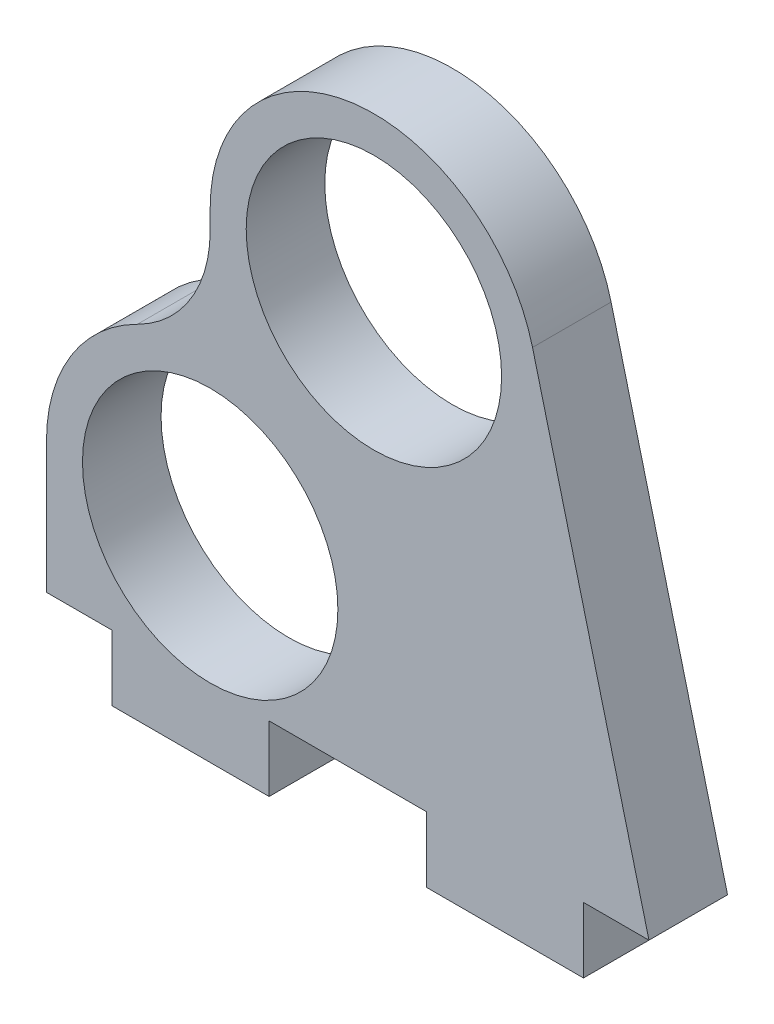
ISO-10303-21;
HEADER;
FILE_DESCRIPTION(('STEP AP214'),'2;1');
FILE_NAME('part.step','',(''),(''),'','','');
FILE_SCHEMA(('AUTOMOTIVE_DESIGN { 1 0 10303 214 1 1 1 1 }'));
ENDSEC;
DATA;
#1=APPLICATION_CONTEXT('core data for automotive mechanical design processes');
#2=APPLICATION_PROTOCOL_DEFINITION('international standard','automotive_design',2000,#1);
#3=PRODUCT_CONTEXT('',#1,'mechanical');
#4=PRODUCT('Part','Part','',(#3));
#5=PRODUCT_RELATED_PRODUCT_CATEGORY('part','',(#4));
#6=PRODUCT_DEFINITION_FORMATION('','',#4);
#7=PRODUCT_DEFINITION_CONTEXT('part definition',#1,'design');
#8=PRODUCT_DEFINITION('design','',#6,#7);
#9=PRODUCT_DEFINITION_SHAPE('','',#8);
#10=(LENGTH_UNIT() NAMED_UNIT(*) SI_UNIT(.MILLI.,.METRE.));
#11=(NAMED_UNIT(*) PLANE_ANGLE_UNIT() SI_UNIT($,.RADIAN.));
#12=(NAMED_UNIT(*) SI_UNIT($,.STERADIAN.) SOLID_ANGLE_UNIT());
#13=UNCERTAINTY_MEASURE_WITH_UNIT(LENGTH_MEASURE(1.E-05),#10,'distance_accuracy_value','');
#14=(GEOMETRIC_REPRESENTATION_CONTEXT(3) GLOBAL_UNCERTAINTY_ASSIGNED_CONTEXT((#13)) GLOBAL_UNIT_ASSIGNED_CONTEXT((#10,
#11,#12)) REPRESENTATION_CONTEXT('',''));
#15=CARTESIAN_POINT('',(0.,0.,0.));
#16=DIRECTION('',(0.,0.,1.));
#17=DIRECTION('',(1.,0.,0.));
#18=AXIS2_PLACEMENT_3D('',#15,#16,#17);
#19=CARTESIAN_POINT('',(12.5000000000001,21.6506350946109,6.));
#20=DIRECTION('',(0.,0.,1.));
#21=DIRECTION('',(1.,0.,0.));
#22=AXIS2_PLACEMENT_3D('',#19,#20,#21);
#23=PLANE('',#22);
#24=CARTESIAN_POINT('',(0.,0.,6.));
#25=DIRECTION('',(0.,0.,1.));
#26=DIRECTION('',(1.,0.,0.));
#27=AXIS2_PLACEMENT_3D('',#24,#25,#26);
#28=CIRCLE('',#27,9.75);
#29=CARTESIAN_POINT('',(9.75,0.,6.));
#30=VERTEX_POINT('',#29);
#31=EDGE_CURVE('E176',#30,#30,#28,.T.);
#32=ORIENTED_EDGE('',*,*,#31,.F.);
#33=EDGE_LOOP('',(#32));
#34=FACE_BOUND('',#33,.T.);
#35=DIRECTION('',(1.,0.,0.));
#36=VECTOR('',#35,1.);
#37=CARTESIAN_POINT('',(-12.5,-10.,6.));
#38=LINE('',#37,#36);
#39=CARTESIAN_POINT('',(-12.5,-10.,6.));
#40=VERTEX_POINT('',#39);
#41=CARTESIAN_POINT('',(-7.5,-10.,6.));
#42=VERTEX_POINT('',#41);
#43=EDGE_CURVE('E201',#40,#42,#38,.T.);
#44=ORIENTED_EDGE('',*,*,#43,.T.);
#45=DIRECTION('',(0.,-1.,0.));
#46=VECTOR('',#45,1.);
#47=CARTESIAN_POINT('',(-7.5,-15.,6.));
#48=LINE('',#47,#46);
#49=CARTESIAN_POINT('',(-7.5,-15.,6.));
#50=VERTEX_POINT('',#49);
#51=EDGE_CURVE('E114',#42,#50,#48,.T.);
#52=ORIENTED_EDGE('',*,*,#51,.T.);
#53=DIRECTION('',(1.,0.,0.));
#54=VECTOR('',#53,1.);
#55=CARTESIAN_POINT('',(4.5,-15.,6.));
#56=LINE('',#55,#54);
#57=CARTESIAN_POINT('',(4.5,-15.,6.));
#58=VERTEX_POINT('',#57);
#59=EDGE_CURVE('E237',#50,#58,#56,.T.);
#60=ORIENTED_EDGE('',*,*,#59,.T.);
#61=DIRECTION('',(0.,1.,0.));
#62=VECTOR('',#61,1.);
#63=CARTESIAN_POINT('',(4.5,-15.,6.));
#64=LINE('',#63,#62);
#65=CARTESIAN_POINT('',(4.5,-10.,6.));
#66=VERTEX_POINT('',#65);
#67=EDGE_CURVE('E256',#58,#66,#64,.T.);
#68=ORIENTED_EDGE('',*,*,#67,.T.);
#69=DIRECTION('',(1.,0.,0.));
#70=VECTOR('',#69,1.);
#71=CARTESIAN_POINT('',(16.5,-10.,6.));
#72=LINE('',#71,#70);
#73=CARTESIAN_POINT('',(16.5,-10.,6.));
#74=VERTEX_POINT('',#73);
#75=EDGE_CURVE('E253',#66,#74,#72,.T.);
#76=ORIENTED_EDGE('',*,*,#75,.T.);
#77=DIRECTION('',(0.,-1.,0.));
#78=VECTOR('',#77,1.);
#79=CARTESIAN_POINT('',(16.5,-15.,6.));
#80=LINE('',#79,#78);
#81=CARTESIAN_POINT('',(16.5,-15.,6.));
#82=VERTEX_POINT('',#81);
#83=EDGE_CURVE('E255',#74,#82,#80,.T.);
#84=ORIENTED_EDGE('',*,*,#83,.T.);
#85=DIRECTION('',(1.,0.,0.));
#86=VECTOR('',#85,1.);
#87=CARTESIAN_POINT('',(28.5,-15.,6.));
#88=LINE('',#87,#86);
#89=CARTESIAN_POINT('',(28.5,-15.,6.));
#90=VERTEX_POINT('',#89);
#91=EDGE_CURVE('E258',#82,#90,#88,.T.);
#92=ORIENTED_EDGE('',*,*,#91,.T.);
#93=DIRECTION('',(0.,1.,0.));
#94=VECTOR('',#93,1.);
#95=CARTESIAN_POINT('',(28.5,-15.,6.));
#96=LINE('',#95,#94);
#97=CARTESIAN_POINT('',(28.5,-10.,6.));
#98=VERTEX_POINT('',#97);
#99=EDGE_CURVE('E264',#90,#98,#96,.T.);
#100=ORIENTED_EDGE('',*,*,#99,.T.);
#101=DIRECTION('',(1.,0.,0.));
#102=VECTOR('',#101,1.);
#103=CARTESIAN_POINT('',(28.5,-10.,6.));
#104=LINE('',#103,#102);
#105=CARTESIAN_POINT('',(33.5,-10.,6.));
#106=VERTEX_POINT('',#105);
#107=EDGE_CURVE('E266',#98,#106,#104,.T.);
#108=ORIENTED_EDGE('',*,*,#107,.T.);
#109=DIRECTION('',(-0.247854237885738,0.96879733523688,0.));
#110=VECTOR('',#109,1.);
#111=CARTESIAN_POINT('',(33.5,-10.,6.));
#112=LINE('',#111,#110);
#113=CARTESIAN_POINT('',(24.6099666904611,24.7488130681826,6.));
#114=VERTEX_POINT('',#113);
#115=EDGE_CURVE('E268',#106,#114,#112,.T.);
#116=ORIENTED_EDGE('',*,*,#115,.T.);
#117=CARTESIAN_POINT('',(12.5000000000001,21.6506350946109,6.));
#118=DIRECTION('',(0.,0.,1.));
#119=DIRECTION('',(1.,0.,0.));
#120=AXIS2_PLACEMENT_3D('',#117,#118,#119);
#121=CIRCLE('',#120,12.5);
#122=CARTESIAN_POINT('',(0.,21.6506350946108,6.));
#123=VERTEX_POINT('',#122);
#124=EDGE_CURVE('E270',#114,#123,#121,.T.);
#125=ORIENTED_EDGE('',*,*,#124,.T.);
#126=DIRECTION('',(0.,-1.,0.));
#127=VECTOR('',#126,1.);
#128=CARTESIAN_POINT('',(0.,21.6506350946108,6.));
#129=LINE('',#128,#127);
#130=CARTESIAN_POINT('',(0.,20.1556443707463,6.));
#131=VERTEX_POINT('',#130);
#132=EDGE_CURVE('E154',#123,#131,#129,.T.);
#133=ORIENTED_EDGE('',*,*,#132,.T.);
#134=CARTESIAN_POINT('',(-9.99999999999992,20.1556443707464,6.));
#135=DIRECTION('',(0.,0.,-1.));
#136=DIRECTION('',(-1.,0.,0.));
#137=AXIS2_PLACEMENT_3D('',#134,#135,#136);
#138=CIRCLE('',#137,10.);
#139=CARTESIAN_POINT('',(-5.55555555555551,11.1975802059702,6.));
#140=VERTEX_POINT('',#139);
#141=EDGE_CURVE('E148',#131,#140,#138,.T.);
#142=ORIENTED_EDGE('',*,*,#141,.T.);
#143=CARTESIAN_POINT('',(0.,0.,6.));
#144=DIRECTION('',(0.,0.,1.));
#145=DIRECTION('',(1.,0.,0.));
#146=AXIS2_PLACEMENT_3D('',#143,#144,#145);
#147=CIRCLE('',#146,12.5);
#148=CARTESIAN_POINT('',(-12.5,0.,6.));
#149=VERTEX_POINT('',#148);
#150=EDGE_CURVE('E152',#140,#149,#147,.T.);
#151=ORIENTED_EDGE('',*,*,#150,.T.);
#152=DIRECTION('',(0.,-1.,0.));
#153=VECTOR('',#152,1.);
#154=CARTESIAN_POINT('',(-12.5,0.,6.));
#155=LINE('',#154,#153);
#156=EDGE_CURVE('E50',#149,#40,#155,.T.);
#157=ORIENTED_EDGE('',*,*,#156,.T.);
#158=EDGE_LOOP('',(#44,#52,#60,#68,#76,#84,#92,#100,#108,#116,#125,#133,#142,#151,#157));
#159=FACE_BOUND('',#158,.T.);
#160=CARTESIAN_POINT('',(12.5000000000001,21.6506350946109,6.));
#161=DIRECTION('',(0.,0.,1.));
#162=DIRECTION('',(1.,0.,0.));
#163=AXIS2_PLACEMENT_3D('',#160,#161,#162);
#164=CIRCLE('',#163,9.75);
#165=CARTESIAN_POINT('',(22.2500000000001,21.6506350946109,6.));
#166=VERTEX_POINT('',#165);
#167=EDGE_CURVE('E312',#166,#166,#164,.T.);
#168=ORIENTED_EDGE('',*,*,#167,.F.);
#169=EDGE_LOOP('',(#168));
#170=FACE_BOUND('',#169,.T.);
#171=ADVANCED_FACE('F33',(#34,#159,#170),#23,.T.);
#172=CARTESIAN_POINT('',(12.5000000000001,21.6506350946109,0.));
#173=DIRECTION('',(0.,0.,1.));
#174=DIRECTION('',(1.,0.,0.));
#175=AXIS2_PLACEMENT_3D('',#172,#173,#174);
#176=PLANE('',#175);
#177=DIRECTION('',(1.,0.,0.));
#178=VECTOR('',#177,1.);
#179=CARTESIAN_POINT('',(-12.5,-10.,0.));
#180=LINE('',#179,#178);
#181=CARTESIAN_POINT('',(-12.5,-10.,0.));
#182=VERTEX_POINT('',#181);
#183=CARTESIAN_POINT('',(-7.5,-10.,0.));
#184=VERTEX_POINT('',#183);
#185=EDGE_CURVE('E172',#182,#184,#180,.T.);
#186=ORIENTED_EDGE('',*,*,#185,.F.);
#187=DIRECTION('',(0.,-1.,0.));
#188=VECTOR('',#187,1.);
#189=CARTESIAN_POINT('',(-12.5,0.,0.));
#190=LINE('',#189,#188);
#191=CARTESIAN_POINT('',(-12.5,0.,0.));
#192=VERTEX_POINT('',#191);
#193=EDGE_CURVE('E106',#192,#182,#190,.T.);
#194=ORIENTED_EDGE('',*,*,#193,.F.);
#195=CARTESIAN_POINT('',(0.,0.,0.));
#196=DIRECTION('',(0.,0.,1.));
#197=DIRECTION('',(1.,0.,0.));
#198=AXIS2_PLACEMENT_3D('',#195,#196,#197);
#199=CIRCLE('',#198,12.5);
#200=CARTESIAN_POINT('',(-5.55555555555551,11.1975802059702,0.));
#201=VERTEX_POINT('',#200);
#202=EDGE_CURVE('E100',#201,#192,#199,.T.);
#203=ORIENTED_EDGE('',*,*,#202,.F.);
#204=CARTESIAN_POINT('',(-9.99999999999992,20.1556443707464,0.));
#205=DIRECTION('',(0.,0.,-1.));
#206=DIRECTION('',(-1.,0.,0.));
#207=AXIS2_PLACEMENT_3D('',#204,#205,#206);
#208=CIRCLE('',#207,10.);
#209=CARTESIAN_POINT('',(0.,20.1556443707463,0.));
#210=VERTEX_POINT('',#209);
#211=EDGE_CURVE('E162',#210,#201,#208,.T.);
#212=ORIENTED_EDGE('',*,*,#211,.F.);
#213=DIRECTION('',(0.,-1.,0.));
#214=VECTOR('',#213,1.);
#215=CARTESIAN_POINT('',(0.,21.6506350946108,0.));
#216=LINE('',#215,#214);
#217=CARTESIAN_POINT('',(0.,21.6506350946108,0.));
#218=VERTEX_POINT('',#217);
#219=EDGE_CURVE('E196',#218,#210,#216,.T.);
#220=ORIENTED_EDGE('',*,*,#219,.F.);
#221=CARTESIAN_POINT('',(12.5000000000001,21.6506350946109,0.));
#222=DIRECTION('',(0.,0.,1.));
#223=DIRECTION('',(1.,0.,0.));
#224=AXIS2_PLACEMENT_3D('',#221,#222,#223);
#225=CIRCLE('',#224,12.5);
#226=CARTESIAN_POINT('',(24.6099666904611,24.7488130681826,0.));
#227=VERTEX_POINT('',#226);
#228=EDGE_CURVE('E194',#227,#218,#225,.T.);
#229=ORIENTED_EDGE('',*,*,#228,.F.);
#230=DIRECTION('',(-0.247854237885738,0.96879733523688,0.));
#231=VECTOR('',#230,1.);
#232=CARTESIAN_POINT('',(33.5,-10.,0.));
#233=LINE('',#232,#231);
#234=CARTESIAN_POINT('',(33.5,-10.,0.));
#235=VERTEX_POINT('',#234);
#236=EDGE_CURVE('E192',#235,#227,#233,.T.);
#237=ORIENTED_EDGE('',*,*,#236,.F.);
#238=DIRECTION('',(1.,0.,0.));
#239=VECTOR('',#238,1.);
#240=CARTESIAN_POINT('',(28.5,-10.,0.));
#241=LINE('',#240,#239);
#242=CARTESIAN_POINT('',(28.5,-10.,0.));
#243=VERTEX_POINT('',#242);
#244=EDGE_CURVE('E190',#243,#235,#241,.T.);
#245=ORIENTED_EDGE('',*,*,#244,.F.);
#246=DIRECTION('',(0.,1.,0.));
#247=VECTOR('',#246,1.);
#248=CARTESIAN_POINT('',(28.5,-15.,0.));
#249=LINE('',#248,#247);
#250=CARTESIAN_POINT('',(28.5,-15.,0.));
#251=VERTEX_POINT('',#250);
#252=EDGE_CURVE('E188',#251,#243,#249,.T.);
#253=ORIENTED_EDGE('',*,*,#252,.F.);
#254=DIRECTION('',(1.,0.,0.));
#255=VECTOR('',#254,1.);
#256=CARTESIAN_POINT('',(28.5,-15.,0.));
#257=LINE('',#256,#255);
#258=CARTESIAN_POINT('',(16.5,-15.,0.));
#259=VERTEX_POINT('',#258);
#260=EDGE_CURVE('E186',#259,#251,#257,.T.);
#261=ORIENTED_EDGE('',*,*,#260,.F.);
#262=DIRECTION('',(0.,-1.,0.));
#263=VECTOR('',#262,1.);
#264=CARTESIAN_POINT('',(16.5,-15.,0.));
#265=LINE('',#264,#263);
#266=CARTESIAN_POINT('',(16.5,-10.,0.));
#267=VERTEX_POINT('',#266);
#268=EDGE_CURVE('E184',#267,#259,#265,.T.);
#269=ORIENTED_EDGE('',*,*,#268,.F.);
#270=DIRECTION('',(1.,0.,0.));
#271=VECTOR('',#270,1.);
#272=CARTESIAN_POINT('',(16.5,-10.,0.));
#273=LINE('',#272,#271);
#274=CARTESIAN_POINT('',(4.5,-10.,0.));
#275=VERTEX_POINT('',#274);
#276=EDGE_CURVE('E182',#275,#267,#273,.T.);
#277=ORIENTED_EDGE('',*,*,#276,.F.);
#278=DIRECTION('',(0.,1.,0.));
#279=VECTOR('',#278,1.);
#280=CARTESIAN_POINT('',(4.5,-15.,0.));
#281=LINE('',#280,#279);
#282=CARTESIAN_POINT('',(4.5,-15.,0.));
#283=VERTEX_POINT('',#282);
#284=EDGE_CURVE('E180',#283,#275,#281,.T.);
#285=ORIENTED_EDGE('',*,*,#284,.F.);
#286=DIRECTION('',(1.,0.,0.));
#287=VECTOR('',#286,1.);
#288=CARTESIAN_POINT('',(4.5,-15.,0.));
#289=LINE('',#288,#287);
#290=CARTESIAN_POINT('',(-7.5,-15.,0.));
#291=VERTEX_POINT('',#290);
#292=EDGE_CURVE('E178',#291,#283,#289,.T.);
#293=ORIENTED_EDGE('',*,*,#292,.F.);
#294=DIRECTION('',(0.,-1.,0.));
#295=VECTOR('',#294,1.);
#296=CARTESIAN_POINT('',(-7.5,-15.,0.));
#297=LINE('',#296,#295);
#298=EDGE_CURVE('E175',#184,#291,#297,.T.);
#299=ORIENTED_EDGE('',*,*,#298,.F.);
#300=EDGE_LOOP('',(#186,#194,#203,#212,#220,#229,#237,#245,#253,#261,#269,#277,#285,#293,#299));
#301=FACE_BOUND('',#300,.T.);
#302=CARTESIAN_POINT('',(0.,0.,0.));
#303=DIRECTION('',(0.,0.,1.));
#304=DIRECTION('',(1.,0.,0.));
#305=AXIS2_PLACEMENT_3D('',#302,#303,#304);
#306=CIRCLE('',#305,9.75);
#307=CARTESIAN_POINT('',(9.75,0.,0.));
#308=VERTEX_POINT('',#307);
#309=EDGE_CURVE('E318',#308,#308,#306,.T.);
#310=ORIENTED_EDGE('',*,*,#309,.T.);
#311=EDGE_LOOP('',(#310));
#312=FACE_BOUND('',#311,.T.);
#313=CARTESIAN_POINT('',(12.5000000000001,21.6506350946109,0.));
#314=DIRECTION('',(0.,0.,1.));
#315=DIRECTION('',(1.,0.,0.));
#316=AXIS2_PLACEMENT_3D('',#313,#314,#315);
#317=CIRCLE('',#316,9.75);
#318=CARTESIAN_POINT('',(22.2500000000001,21.6506350946109,0.));
#319=VERTEX_POINT('',#318);
#320=EDGE_CURVE('E315',#319,#319,#317,.T.);
#321=ORIENTED_EDGE('',*,*,#320,.T.);
#322=EDGE_LOOP('',(#321));
#323=FACE_BOUND('',#322,.T.);
#324=ADVANCED_FACE('F241',(#301,#312,#323),#176,.F.);
#325=CARTESIAN_POINT('',(-12.5,-10.,6.));
#326=DIRECTION('',(0.,1.,0.));
#327=DIRECTION('',(-1.,0.,0.));
#328=AXIS2_PLACEMENT_3D('',#325,#326,#327);
#329=PLANE('',#328);
#330=ORIENTED_EDGE('',*,*,#185,.T.);
#331=DIRECTION('',(0.,0.,-1.));
#332=VECTOR('',#331,1.);
#333=CARTESIAN_POINT('',(-7.5,-10.,6.));
#334=LINE('',#333,#332);
#335=EDGE_CURVE('E11',#42,#184,#334,.T.);
#336=ORIENTED_EDGE('',*,*,#335,.F.);
#337=ORIENTED_EDGE('',*,*,#43,.F.);
#338=DIRECTION('',(0.,0.,-1.));
#339=VECTOR('',#338,1.);
#340=CARTESIAN_POINT('',(-12.5,-10.,6.));
#341=LINE('',#340,#339);
#342=EDGE_CURVE('E168',#40,#182,#341,.T.);
#343=ORIENTED_EDGE('',*,*,#342,.T.);
#344=EDGE_LOOP('',(#330,#336,#337,#343));
#345=FACE_BOUND('',#344,.T.);
#346=ADVANCED_FACE('F35',(#345),#329,.F.);
#347=CARTESIAN_POINT('',(-7.5,-15.,6.));
#348=DIRECTION('',(1.,0.,0.));
#349=DIRECTION('',(0.,0.,-1.));
#350=AXIS2_PLACEMENT_3D('',#347,#348,#349);
#351=PLANE('',#350);
#352=ORIENTED_EDGE('',*,*,#298,.T.);
#353=DIRECTION('',(0.,0.,-1.));
#354=VECTOR('',#353,1.);
#355=CARTESIAN_POINT('',(-7.5,-15.,6.));
#356=LINE('',#355,#354);
#357=EDGE_CURVE('E42',#50,#291,#356,.T.);
#358=ORIENTED_EDGE('',*,*,#357,.F.);
#359=ORIENTED_EDGE('',*,*,#51,.F.);
#360=ORIENTED_EDGE('',*,*,#335,.T.);
#361=EDGE_LOOP('',(#352,#358,#359,#360));
#362=FACE_BOUND('',#361,.T.);
#363=ADVANCED_FACE('F441',(#362),#351,.F.);
#364=CARTESIAN_POINT('',(4.5,-15.,6.));
#365=DIRECTION('',(0.,1.,0.));
#366=DIRECTION('',(-1.,0.,0.));
#367=AXIS2_PLACEMENT_3D('',#364,#365,#366);
#368=PLANE('',#367);
#369=ORIENTED_EDGE('',*,*,#292,.T.);
#370=DIRECTION('',(0.,0.,-1.));
#371=VECTOR('',#370,1.);
#372=CARTESIAN_POINT('',(4.5,-15.,6.));
#373=LINE('',#372,#371);
#374=EDGE_CURVE('E229',#58,#283,#373,.T.);
#375=ORIENTED_EDGE('',*,*,#374,.F.);
#376=ORIENTED_EDGE('',*,*,#59,.F.);
#377=ORIENTED_EDGE('',*,*,#357,.T.);
#378=EDGE_LOOP('',(#369,#375,#376,#377));
#379=FACE_BOUND('',#378,.T.);
#380=ADVANCED_FACE('F235',(#379),#368,.F.);
#381=CARTESIAN_POINT('',(4.5,-15.,6.));
#382=DIRECTION('',(-1.,0.,0.));
#383=DIRECTION('',(0.,0.,1.));
#384=AXIS2_PLACEMENT_3D('',#381,#382,#383);
#385=PLANE('',#384);
#386=ORIENTED_EDGE('',*,*,#284,.T.);
#387=DIRECTION('',(0.,0.,-1.));
#388=VECTOR('',#387,1.);
#389=CARTESIAN_POINT('',(4.5,-10.,6.));
#390=LINE('',#389,#388);
#391=EDGE_CURVE('E226',#66,#275,#390,.T.);
#392=ORIENTED_EDGE('',*,*,#391,.F.);
#393=ORIENTED_EDGE('',*,*,#67,.F.);
#394=ORIENTED_EDGE('',*,*,#374,.T.);
#395=EDGE_LOOP('',(#386,#392,#393,#394));
#396=FACE_BOUND('',#395,.T.);
#397=ADVANCED_FACE('F247',(#396),#385,.F.);
#398=CARTESIAN_POINT('',(16.5,-10.,6.));
#399=DIRECTION('',(0.,1.,0.));
#400=DIRECTION('',(-1.,0.,0.));
#401=AXIS2_PLACEMENT_3D('',#398,#399,#400);
#402=PLANE('',#401);
#403=ORIENTED_EDGE('',*,*,#276,.T.);
#404=DIRECTION('',(0.,0.,-1.));
#405=VECTOR('',#404,1.);
#406=CARTESIAN_POINT('',(16.5,-10.,6.));
#407=LINE('',#406,#405);
#408=EDGE_CURVE('E223',#74,#267,#407,.T.);
#409=ORIENTED_EDGE('',*,*,#408,.F.);
#410=ORIENTED_EDGE('',*,*,#75,.F.);
#411=ORIENTED_EDGE('',*,*,#391,.T.);
#412=EDGE_LOOP('',(#403,#409,#410,#411));
#413=FACE_BOUND('',#412,.T.);
#414=ADVANCED_FACE('F251',(#413),#402,.F.);
#415=CARTESIAN_POINT('',(16.5,-15.,6.));
#416=DIRECTION('',(1.,0.,0.));
#417=DIRECTION('',(0.,0.,-1.));
#418=AXIS2_PLACEMENT_3D('',#415,#416,#417);
#419=PLANE('',#418);
#420=ORIENTED_EDGE('',*,*,#268,.T.);
#421=DIRECTION('',(0.,0.,-1.));
#422=VECTOR('',#421,1.);
#423=CARTESIAN_POINT('',(16.5,-15.,6.));
#424=LINE('',#423,#422);
#425=EDGE_CURVE('E220',#82,#259,#424,.T.);
#426=ORIENTED_EDGE('',*,*,#425,.F.);
#427=ORIENTED_EDGE('',*,*,#83,.F.);
#428=ORIENTED_EDGE('',*,*,#408,.T.);
#429=EDGE_LOOP('',(#420,#426,#427,#428));
#430=FACE_BOUND('',#429,.T.);
#431=ADVANCED_FACE('F406',(#430),#419,.F.);
#432=CARTESIAN_POINT('',(28.5,-15.,6.));
#433=DIRECTION('',(0.,1.,0.));
#434=DIRECTION('',(-1.,0.,0.));
#435=AXIS2_PLACEMENT_3D('',#432,#433,#434);
#436=PLANE('',#435);
#437=ORIENTED_EDGE('',*,*,#260,.T.);
#438=DIRECTION('',(0.,0.,-1.));
#439=VECTOR('',#438,1.);
#440=CARTESIAN_POINT('',(28.5,-15.,6.));
#441=LINE('',#440,#439);
#442=EDGE_CURVE('E217',#90,#251,#441,.T.);
#443=ORIENTED_EDGE('',*,*,#442,.F.);
#444=ORIENTED_EDGE('',*,*,#91,.F.);
#445=ORIENTED_EDGE('',*,*,#425,.T.);
#446=EDGE_LOOP('',(#437,#443,#444,#445));
#447=FACE_BOUND('',#446,.T.);
#448=ADVANCED_FACE('F396',(#447),#436,.F.);
#449=CARTESIAN_POINT('',(28.5,-15.,6.));
#450=DIRECTION('',(-1.,0.,0.));
#451=DIRECTION('',(0.,0.,1.));
#452=AXIS2_PLACEMENT_3D('',#449,#450,#451);
#453=PLANE('',#452);
#454=ORIENTED_EDGE('',*,*,#252,.T.);
#455=DIRECTION('',(0.,0.,-1.));
#456=VECTOR('',#455,1.);
#457=CARTESIAN_POINT('',(28.5,-10.,6.));
#458=LINE('',#457,#456);
#459=EDGE_CURVE('E214',#98,#243,#458,.T.);
#460=ORIENTED_EDGE('',*,*,#459,.F.);
#461=ORIENTED_EDGE('',*,*,#99,.F.);
#462=ORIENTED_EDGE('',*,*,#442,.T.);
#463=EDGE_LOOP('',(#454,#460,#461,#462));
#464=FACE_BOUND('',#463,.T.);
#465=ADVANCED_FACE('F386',(#464),#453,.F.);
#466=CARTESIAN_POINT('',(28.5,-10.,6.));
#467=DIRECTION('',(0.,1.,0.));
#468=DIRECTION('',(0.,0.,1.));
#469=AXIS2_PLACEMENT_3D('',#466,#467,#468);
#470=PLANE('',#469);
#471=ORIENTED_EDGE('',*,*,#244,.T.);
#472=DIRECTION('',(0.,0.,-1.));
#473=VECTOR('',#472,1.);
#474=CARTESIAN_POINT('',(33.5,-10.,6.));
#475=LINE('',#474,#473);
#476=EDGE_CURVE('E211',#106,#235,#475,.T.);
#477=ORIENTED_EDGE('',*,*,#476,.F.);
#478=ORIENTED_EDGE('',*,*,#107,.F.);
#479=ORIENTED_EDGE('',*,*,#459,.T.);
#480=EDGE_LOOP('',(#471,#477,#478,#479));
#481=FACE_BOUND('',#480,.T.);
#482=ADVANCED_FACE('F376',(#481),#470,.F.);
#483=CARTESIAN_POINT('',(33.5,-10.,6.));
#484=DIRECTION('',(-0.96879733523688,-0.247854237885738,0.));
#485=DIRECTION('',(0.247854237885738,-0.96879733523688,0.));
#486=AXIS2_PLACEMENT_3D('',#483,#484,#485);
#487=PLANE('',#486);
#488=ORIENTED_EDGE('',*,*,#236,.T.);
#489=DIRECTION('',(0.,0.,-1.));
#490=VECTOR('',#489,1.);
#491=CARTESIAN_POINT('',(24.6099666904611,24.7488130681826,6.));
#492=LINE('',#491,#490);
#493=EDGE_CURVE('E208',#114,#227,#492,.T.);
#494=ORIENTED_EDGE('',*,*,#493,.F.);
#495=ORIENTED_EDGE('',*,*,#115,.F.);
#496=ORIENTED_EDGE('',*,*,#476,.T.);
#497=EDGE_LOOP('',(#488,#494,#495,#496));
#498=FACE_BOUND('',#497,.T.);
#499=ADVANCED_FACE('F367',(#498),#487,.F.);
#500=CARTESIAN_POINT('',(12.5000000000001,21.6506350946109,6.));
#501=DIRECTION('',(0.,0.,-1.));
#502=DIRECTION('',(-1.,0.,0.));
#503=AXIS2_PLACEMENT_3D('',#500,#501,#502);
#504=CYLINDRICAL_SURFACE('',#503,12.5);
#505=ORIENTED_EDGE('',*,*,#228,.T.);
#506=DIRECTION('',(0.,0.,-1.));
#507=VECTOR('',#506,1.);
#508=CARTESIAN_POINT('',(0.,21.6506350946108,6.));
#509=LINE('',#508,#507);
#510=EDGE_CURVE('E205',#123,#218,#509,.T.);
#511=ORIENTED_EDGE('',*,*,#510,.F.);
#512=ORIENTED_EDGE('',*,*,#124,.F.);
#513=ORIENTED_EDGE('',*,*,#493,.T.);
#514=EDGE_LOOP('',(#505,#511,#512,#513));
#515=FACE_BOUND('',#514,.T.);
#516=ADVANCED_FACE('F276',(#515),#504,.T.);
#517=CARTESIAN_POINT('',(0.,21.6506350946108,6.));
#518=DIRECTION('',(1.,0.,0.));
#519=DIRECTION('',(0.,1.,0.));
#520=AXIS2_PLACEMENT_3D('',#517,#518,#519);
#521=PLANE('',#520);
#522=ORIENTED_EDGE('',*,*,#219,.T.);
#523=DIRECTION('',(0.,0.,-1.));
#524=VECTOR('',#523,1.);
#525=CARTESIAN_POINT('',(0.,20.1556443707463,6.));
#526=LINE('',#525,#524);
#527=EDGE_CURVE('E163',#131,#210,#526,.T.);
#528=ORIENTED_EDGE('',*,*,#527,.F.);
#529=ORIENTED_EDGE('',*,*,#132,.F.);
#530=ORIENTED_EDGE('',*,*,#510,.T.);
#531=EDGE_LOOP('',(#522,#528,#529,#530));
#532=FACE_BOUND('',#531,.T.);
#533=ADVANCED_FACE('F280',(#532),#521,.F.);
#534=CARTESIAN_POINT('',(-9.99999999999992,20.1556443707464,6.));
#535=DIRECTION('',(0.,0.,-1.));
#536=DIRECTION('',(-1.,0.,0.));
#537=AXIS2_PLACEMENT_3D('',#534,#535,#536);
#538=CYLINDRICAL_SURFACE('',#537,10.);
#539=ORIENTED_EDGE('',*,*,#211,.T.);
#540=DIRECTION('',(0.,0.,-1.));
#541=VECTOR('',#540,1.);
#542=CARTESIAN_POINT('',(-5.55555555555551,11.1975802059702,6.));
#543=LINE('',#542,#541);
#544=EDGE_CURVE('E159',#140,#201,#543,.T.);
#545=ORIENTED_EDGE('',*,*,#544,.F.);
#546=ORIENTED_EDGE('',*,*,#141,.F.);
#547=ORIENTED_EDGE('',*,*,#527,.T.);
#548=EDGE_LOOP('',(#539,#545,#546,#547));
#549=FACE_BOUND('',#548,.T.);
#550=ADVANCED_FACE('F160',(#549),#538,.F.);
#551=CARTESIAN_POINT('',(0.,0.,6.));
#552=DIRECTION('',(0.,0.,-1.));
#553=DIRECTION('',(-1.,0.,0.));
#554=AXIS2_PLACEMENT_3D('',#551,#552,#553);
#555=CYLINDRICAL_SURFACE('',#554,12.5);
#556=ORIENTED_EDGE('',*,*,#202,.T.);
#557=DIRECTION('',(0.,0.,-1.));
#558=VECTOR('',#557,1.);
#559=CARTESIAN_POINT('',(-12.5,0.,6.));
#560=LINE('',#559,#558);
#561=EDGE_CURVE('E164',#149,#192,#560,.T.);
#562=ORIENTED_EDGE('',*,*,#561,.F.);
#563=ORIENTED_EDGE('',*,*,#150,.F.);
#564=ORIENTED_EDGE('',*,*,#544,.T.);
#565=EDGE_LOOP('',(#556,#562,#563,#564));
#566=FACE_BOUND('',#565,.T.);
#567=ADVANCED_FACE('F166',(#566),#555,.T.);
#568=CARTESIAN_POINT('',(-12.5,0.,6.));
#569=DIRECTION('',(1.,0.,0.));
#570=DIRECTION('',(0.,1.,0.));
#571=AXIS2_PLACEMENT_3D('',#568,#569,#570);
#572=PLANE('',#571);
#573=ORIENTED_EDGE('',*,*,#193,.T.);
#574=ORIENTED_EDGE('',*,*,#342,.F.);
#575=ORIENTED_EDGE('',*,*,#156,.F.);
#576=ORIENTED_EDGE('',*,*,#561,.T.);
#577=EDGE_LOOP('',(#573,#574,#575,#576));
#578=FACE_BOUND('',#577,.T.);
#579=ADVANCED_FACE('F284',(#578),#572,.F.);
#580=CARTESIAN_POINT('',(0.,0.,6.));
#581=DIRECTION('',(0.,0.,-1.));
#582=DIRECTION('',(-1.,0.,0.));
#583=AXIS2_PLACEMENT_3D('',#580,#581,#582);
#584=CYLINDRICAL_SURFACE('',#583,9.75);
#585=ORIENTED_EDGE('',*,*,#31,.T.);
#586=EDGE_LOOP('',(#585));
#587=FACE_BOUND('',#586,.T.);
#588=ORIENTED_EDGE('',*,*,#309,.F.);
#589=EDGE_LOOP('',(#588));
#590=FACE_BOUND('',#589,.T.);
#591=ADVANCED_FACE('F286',(#587,#590),#584,.F.);
#592=CARTESIAN_POINT('',(12.5000000000001,21.6506350946109,6.));
#593=DIRECTION('',(0.,0.,-1.));
#594=DIRECTION('',(-1.,0.,0.));
#595=AXIS2_PLACEMENT_3D('',#592,#593,#594);
#596=CYLINDRICAL_SURFACE('',#595,9.75);
#597=ORIENTED_EDGE('',*,*,#167,.T.);
#598=EDGE_LOOP('',(#597));
#599=FACE_BOUND('',#598,.T.);
#600=ORIENTED_EDGE('',*,*,#320,.F.);
#601=EDGE_LOOP('',(#600));
#602=FACE_BOUND('',#601,.T.);
#603=ADVANCED_FACE('F292',(#599,#602),#596,.F.);
#604=CLOSED_SHELL('',(#171,#324,#346,#363,#380,#397,#414,#431,#448,#465,#482,#499,#516,#533,
#550,#567,#579,#591,#603));
#605=MANIFOLD_SOLID_BREP('B2',#604);
#606=ADVANCED_BREP_SHAPE_REPRESENTATION('',(#18,#605),#14);
#607=SHAPE_DEFINITION_REPRESENTATION(#9,#606);
ENDSEC;
END-ISO-10303-21;
